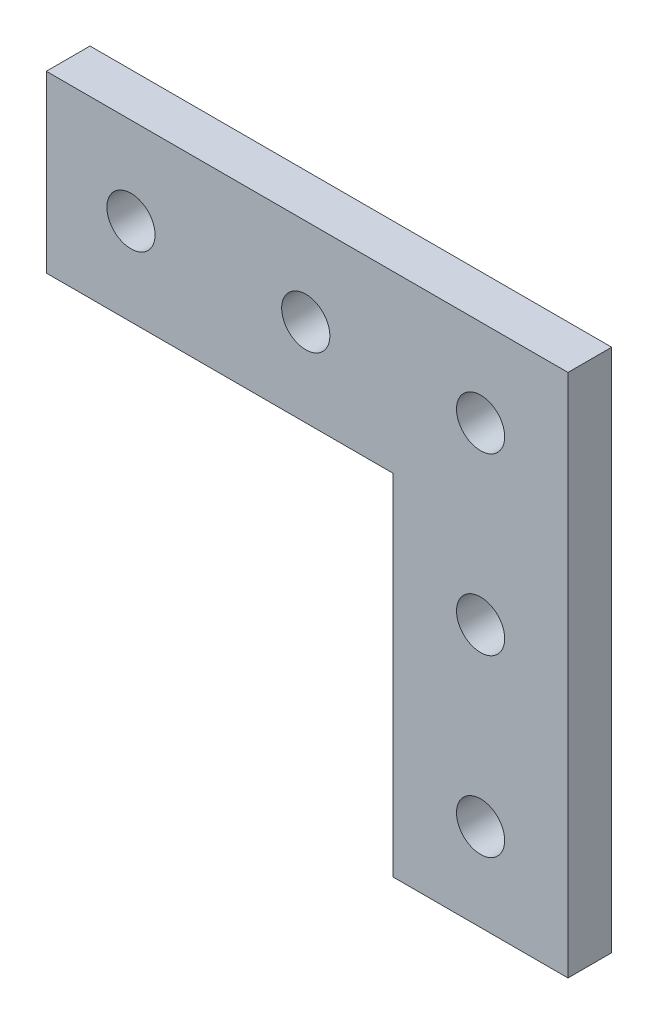
ISO-10303-21;
HEADER;
FILE_DESCRIPTION(('STEP AP214'),'2;1');
FILE_NAME('part.step','',(''),(''),'','','');
FILE_SCHEMA(('AUTOMOTIVE_DESIGN { 1 0 10303 214 1 1 1 1 }'));
ENDSEC;
DATA;
#1=APPLICATION_CONTEXT('core data for automotive mechanical design processes');
#2=APPLICATION_PROTOCOL_DEFINITION('international standard','automotive_design',2000,#1);
#3=PRODUCT_CONTEXT('',#1,'mechanical');
#4=PRODUCT('Part','Part','',(#3));
#5=PRODUCT_RELATED_PRODUCT_CATEGORY('part','',(#4));
#6=PRODUCT_DEFINITION_FORMATION('','',#4);
#7=PRODUCT_DEFINITION_CONTEXT('part definition',#1,'design');
#8=PRODUCT_DEFINITION('design','',#6,#7);
#9=PRODUCT_DEFINITION_SHAPE('','',#8);
#10=(LENGTH_UNIT() NAMED_UNIT(*) SI_UNIT(.MILLI.,.METRE.));
#11=(NAMED_UNIT(*) PLANE_ANGLE_UNIT() SI_UNIT($,.RADIAN.));
#12=(NAMED_UNIT(*) SI_UNIT($,.STERADIAN.) SOLID_ANGLE_UNIT());
#13=UNCERTAINTY_MEASURE_WITH_UNIT(LENGTH_MEASURE(1.E-05),#10,'distance_accuracy_value','');
#14=(GEOMETRIC_REPRESENTATION_CONTEXT(3) GLOBAL_UNCERTAINTY_ASSIGNED_CONTEXT((#13)) GLOBAL_UNIT_ASSIGNED_CONTEXT((#10,
#11,#12)) REPRESENTATION_CONTEXT('',''));
#15=CARTESIAN_POINT('',(0.,0.,0.));
#16=DIRECTION('',(0.,0.,1.));
#17=DIRECTION('',(1.,0.,0.));
#18=AXIS2_PLACEMENT_3D('',#15,#16,#17);
#19=CARTESIAN_POINT('',(12.7,50.8,6.35));
#20=DIRECTION('',(-1.,0.,0.));
#21=DIRECTION('',(0.,0.,1.));
#22=AXIS2_PLACEMENT_3D('',#19,#20,#21);
#23=PLANE('',#22);
#24=DIRECTION('',(0.,1.,0.));
#25=VECTOR('',#24,1.);
#26=CARTESIAN_POINT('',(12.7,50.8,0.));
#27=LINE('',#26,#25);
#28=CARTESIAN_POINT('',(12.7,0.,0.));
#29=VERTEX_POINT('',#28);
#30=CARTESIAN_POINT('',(12.7,76.2,0.));
#31=VERTEX_POINT('',#30);
#32=EDGE_CURVE('E83',#29,#31,#27,.T.);
#33=ORIENTED_EDGE('',*,*,#32,.T.);
#34=DIRECTION('',(0.,0.,-1.));
#35=VECTOR('',#34,1.);
#36=CARTESIAN_POINT('',(12.7,76.2,6.35));
#37=LINE('',#36,#35);
#38=CARTESIAN_POINT('',(12.7,76.2,6.35));
#39=VERTEX_POINT('',#38);
#40=EDGE_CURVE('E11',#39,#31,#37,.T.);
#41=ORIENTED_EDGE('',*,*,#40,.F.);
#42=DIRECTION('',(0.,1.,0.));
#43=VECTOR('',#42,1.);
#44=CARTESIAN_POINT('',(12.7,50.8,6.35));
#45=LINE('',#44,#43);
#46=CARTESIAN_POINT('',(12.7,0.,6.35));
#47=VERTEX_POINT('',#46);
#48=EDGE_CURVE('E89',#47,#39,#45,.T.);
#49=ORIENTED_EDGE('',*,*,#48,.F.);
#50=DIRECTION('',(0.,0.,-1.));
#51=VECTOR('',#50,1.);
#52=CARTESIAN_POINT('',(12.7,0.,6.35));
#53=LINE('',#52,#51);
#54=EDGE_CURVE('E117',#47,#29,#53,.T.);
#55=ORIENTED_EDGE('',*,*,#54,.T.);
#56=EDGE_LOOP('',(#33,#41,#49,#55));
#57=FACE_BOUND('',#56,.T.);
#58=ADVANCED_FACE('F37',(#57),#23,.F.);
#59=CARTESIAN_POINT('',(12.7,76.2,6.35));
#60=DIRECTION('',(0.,-1.,0.));
#61=DIRECTION('',(0.,0.,-1.));
#62=AXIS2_PLACEMENT_3D('',#59,#60,#61);
#63=PLANE('',#62);
#64=DIRECTION('',(-1.,0.,0.));
#65=VECTOR('',#64,1.);
#66=CARTESIAN_POINT('',(12.7,76.2,0.));
#67=LINE('',#66,#65);
#68=CARTESIAN_POINT('',(-63.1,76.2,0.));
#69=VERTEX_POINT('',#68);
#70=EDGE_CURVE('E122',#31,#69,#67,.T.);
#71=ORIENTED_EDGE('',*,*,#70,.T.);
#72=DIRECTION('',(0.,0.,-1.));
#73=VECTOR('',#72,1.);
#74=CARTESIAN_POINT('',(-63.1,76.2,6.35));
#75=LINE('',#74,#73);
#76=CARTESIAN_POINT('',(-63.1,76.2,6.35));
#77=VERTEX_POINT('',#76);
#78=EDGE_CURVE('E45',#77,#69,#75,.T.);
#79=ORIENTED_EDGE('',*,*,#78,.F.);
#80=DIRECTION('',(-1.,0.,0.));
#81=VECTOR('',#80,1.);
#82=CARTESIAN_POINT('',(12.7,76.2,6.35));
#83=LINE('',#82,#81);
#84=EDGE_CURVE('E145',#39,#77,#83,.T.);
#85=ORIENTED_EDGE('',*,*,#84,.F.);
#86=ORIENTED_EDGE('',*,*,#40,.T.);
#87=EDGE_LOOP('',(#71,#79,#85,#86));
#88=FACE_BOUND('',#87,.T.);
#89=ADVANCED_FACE('F214',(#88),#63,.F.);
#90=CARTESIAN_POINT('',(-63.1,76.2,6.35));
#91=DIRECTION('',(1.,0.,0.));
#92=DIRECTION('',(0.,0.,-1.));
#93=AXIS2_PLACEMENT_3D('',#90,#91,#92);
#94=PLANE('',#93);
#95=DIRECTION('',(0.,-1.,0.));
#96=VECTOR('',#95,1.);
#97=CARTESIAN_POINT('',(-63.1,76.2,0.));
#98=LINE('',#97,#96);
#99=CARTESIAN_POINT('',(-63.1,50.8,0.));
#100=VERTEX_POINT('',#99);
#101=EDGE_CURVE('E125',#69,#100,#98,.T.);
#102=ORIENTED_EDGE('',*,*,#101,.T.);
#103=DIRECTION('',(0.,0.,-1.));
#104=VECTOR('',#103,1.);
#105=CARTESIAN_POINT('',(-63.1,50.8,6.35));
#106=LINE('',#105,#104);
#107=CARTESIAN_POINT('',(-63.1,50.8,6.35));
#108=VERTEX_POINT('',#107);
#109=EDGE_CURVE('E112',#108,#100,#106,.T.);
#110=ORIENTED_EDGE('',*,*,#109,.F.);
#111=DIRECTION('',(0.,-1.,0.));
#112=VECTOR('',#111,1.);
#113=CARTESIAN_POINT('',(-63.1,76.2,6.35));
#114=LINE('',#113,#112);
#115=EDGE_CURVE('E103',#77,#108,#114,.T.);
#116=ORIENTED_EDGE('',*,*,#115,.F.);
#117=ORIENTED_EDGE('',*,*,#78,.T.);
#118=EDGE_LOOP('',(#102,#110,#116,#117));
#119=FACE_BOUND('',#118,.T.);
#120=ADVANCED_FACE('F138',(#119),#94,.F.);
#121=CARTESIAN_POINT('',(-63.1,50.8,6.35));
#122=DIRECTION('',(0.,1.,0.));
#123=DIRECTION('',(0.,0.,1.));
#124=AXIS2_PLACEMENT_3D('',#121,#122,#123);
#125=PLANE('',#124);
#126=DIRECTION('',(1.,0.,0.));
#127=VECTOR('',#126,1.);
#128=CARTESIAN_POINT('',(-63.1,50.8,0.));
#129=LINE('',#128,#127);
#130=CARTESIAN_POINT('',(-12.7,50.8,0.));
#131=VERTEX_POINT('',#130);
#132=EDGE_CURVE('E111',#100,#131,#129,.T.);
#133=ORIENTED_EDGE('',*,*,#132,.T.);
#134=DIRECTION('',(0.,0.,-1.));
#135=VECTOR('',#134,1.);
#136=CARTESIAN_POINT('',(-12.7,50.8,6.35));
#137=LINE('',#136,#135);
#138=CARTESIAN_POINT('',(-12.7,50.8,6.35));
#139=VERTEX_POINT('',#138);
#140=EDGE_CURVE('E108',#139,#131,#137,.T.);
#141=ORIENTED_EDGE('',*,*,#140,.F.);
#142=DIRECTION('',(1.,0.,0.));
#143=VECTOR('',#142,1.);
#144=CARTESIAN_POINT('',(-63.1,50.8,6.35));
#145=LINE('',#144,#143);
#146=EDGE_CURVE('E97',#108,#139,#145,.T.);
#147=ORIENTED_EDGE('',*,*,#146,.F.);
#148=ORIENTED_EDGE('',*,*,#109,.T.);
#149=EDGE_LOOP('',(#133,#141,#147,#148));
#150=FACE_BOUND('',#149,.T.);
#151=ADVANCED_FACE('F109',(#150),#125,.F.);
#152=CARTESIAN_POINT('',(-12.7,0.,6.35));
#153=DIRECTION('',(1.,0.,0.));
#154=DIRECTION('',(0.,0.,-1.));
#155=AXIS2_PLACEMENT_3D('',#152,#153,#154);
#156=PLANE('',#155);
#157=DIRECTION('',(0.,-1.,0.));
#158=VECTOR('',#157,1.);
#159=CARTESIAN_POINT('',(-12.7,0.,0.));
#160=LINE('',#159,#158);
#161=CARTESIAN_POINT('',(-12.7,0.,0.));
#162=VERTEX_POINT('',#161);
#163=EDGE_CURVE('E76',#131,#162,#160,.T.);
#164=ORIENTED_EDGE('',*,*,#163,.T.);
#165=DIRECTION('',(0.,0.,-1.));
#166=VECTOR('',#165,1.);
#167=CARTESIAN_POINT('',(-12.7,0.,6.35));
#168=LINE('',#167,#166);
#169=CARTESIAN_POINT('',(-12.7,0.,6.35));
#170=VERTEX_POINT('',#169);
#171=EDGE_CURVE('E113',#170,#162,#168,.T.);
#172=ORIENTED_EDGE('',*,*,#171,.F.);
#173=DIRECTION('',(0.,-1.,0.));
#174=VECTOR('',#173,1.);
#175=CARTESIAN_POINT('',(-12.7,0.,6.35));
#176=LINE('',#175,#174);
#177=EDGE_CURVE('E101',#139,#170,#176,.T.);
#178=ORIENTED_EDGE('',*,*,#177,.F.);
#179=ORIENTED_EDGE('',*,*,#140,.T.);
#180=EDGE_LOOP('',(#164,#172,#178,#179));
#181=FACE_BOUND('',#180,.T.);
#182=ADVANCED_FACE('F115',(#181),#156,.F.);
#183=CARTESIAN_POINT('',(12.7,0.,6.35));
#184=DIRECTION('',(0.,1.,0.));
#185=DIRECTION('',(-1.,0.,0.));
#186=AXIS2_PLACEMENT_3D('',#183,#184,#185);
#187=PLANE('',#186);
#188=DIRECTION('',(1.,0.,0.));
#189=VECTOR('',#188,1.);
#190=CARTESIAN_POINT('',(12.7,0.,0.));
#191=LINE('',#190,#189);
#192=EDGE_CURVE('E129',#162,#29,#191,.T.);
#193=ORIENTED_EDGE('',*,*,#192,.T.);
#194=ORIENTED_EDGE('',*,*,#54,.F.);
#195=DIRECTION('',(1.,0.,0.));
#196=VECTOR('',#195,1.);
#197=CARTESIAN_POINT('',(12.7,0.,6.35));
#198=LINE('',#197,#196);
#199=EDGE_CURVE('E53',#170,#47,#198,.T.);
#200=ORIENTED_EDGE('',*,*,#199,.F.);
#201=ORIENTED_EDGE('',*,*,#171,.T.);
#202=EDGE_LOOP('',(#193,#194,#200,#201));
#203=FACE_BOUND('',#202,.T.);
#204=ADVANCED_FACE('F143',(#203),#187,.F.);
#205=CARTESIAN_POINT('',(0.,0.,6.35));
#206=DIRECTION('',(0.,0.,-1.));
#207=DIRECTION('',(-1.,0.,0.));
#208=AXIS2_PLACEMENT_3D('',#205,#206,#207);
#209=PLANE('',#208);
#210=CARTESIAN_POINT('',(-50.8,63.5,6.35));
#211=DIRECTION('',(0.,0.,1.));
#212=DIRECTION('',(1.,0.,0.));
#213=AXIS2_PLACEMENT_3D('',#210,#211,#212);
#214=CIRCLE('',#213,3.5);
#215=CARTESIAN_POINT('',(-47.3,63.5,6.35));
#216=VERTEX_POINT('',#215);
#217=EDGE_CURVE('E173',#216,#216,#214,.T.);
#218=ORIENTED_EDGE('',*,*,#217,.F.);
#219=EDGE_LOOP('',(#218));
#220=FACE_BOUND('',#219,.T.);
#221=CARTESIAN_POINT('',(0.,63.5,6.35));
#222=DIRECTION('',(0.,0.,1.));
#223=DIRECTION('',(1.,0.,0.));
#224=AXIS2_PLACEMENT_3D('',#221,#222,#223);
#225=CIRCLE('',#224,3.5);
#226=CARTESIAN_POINT('',(3.5,63.5,6.35));
#227=VERTEX_POINT('',#226);
#228=EDGE_CURVE('E167',#227,#227,#225,.T.);
#229=ORIENTED_EDGE('',*,*,#228,.F.);
#230=EDGE_LOOP('',(#229));
#231=FACE_BOUND('',#230,.T.);
#232=CARTESIAN_POINT('',(-25.4,63.5,6.35));
#233=DIRECTION('',(0.,0.,1.));
#234=DIRECTION('',(1.,0.,0.));
#235=AXIS2_PLACEMENT_3D('',#232,#233,#234);
#236=CIRCLE('',#235,3.5);
#237=CARTESIAN_POINT('',(-21.9,63.5,6.35));
#238=VERTEX_POINT('',#237);
#239=EDGE_CURVE('E161',#238,#238,#236,.T.);
#240=ORIENTED_EDGE('',*,*,#239,.F.);
#241=EDGE_LOOP('',(#240));
#242=FACE_BOUND('',#241,.T.);
#243=CARTESIAN_POINT('',(0.,38.1,6.35));
#244=DIRECTION('',(0.,0.,1.));
#245=DIRECTION('',(1.,0.,0.));
#246=AXIS2_PLACEMENT_3D('',#243,#244,#245);
#247=CIRCLE('',#246,3.5);
#248=CARTESIAN_POINT('',(3.5,38.1,6.35));
#249=VERTEX_POINT('',#248);
#250=EDGE_CURVE('E155',#249,#249,#247,.T.);
#251=ORIENTED_EDGE('',*,*,#250,.F.);
#252=EDGE_LOOP('',(#251));
#253=FACE_BOUND('',#252,.T.);
#254=CARTESIAN_POINT('',(0.,12.7,6.35));
#255=DIRECTION('',(0.,0.,1.));
#256=DIRECTION('',(1.,0.,0.));
#257=AXIS2_PLACEMENT_3D('',#254,#255,#256);
#258=CIRCLE('',#257,3.5);
#259=CARTESIAN_POINT('',(3.5,12.7,6.35));
#260=VERTEX_POINT('',#259);
#261=EDGE_CURVE('E149',#260,#260,#258,.T.);
#262=ORIENTED_EDGE('',*,*,#261,.F.);
#263=EDGE_LOOP('',(#262));
#264=FACE_BOUND('',#263,.T.);
#265=ORIENTED_EDGE('',*,*,#48,.T.);
#266=ORIENTED_EDGE('',*,*,#84,.T.);
#267=ORIENTED_EDGE('',*,*,#115,.T.);
#268=ORIENTED_EDGE('',*,*,#146,.T.);
#269=ORIENTED_EDGE('',*,*,#177,.T.);
#270=ORIENTED_EDGE('',*,*,#199,.T.);
#271=EDGE_LOOP('',(#265,#266,#267,#268,#269,#270));
#272=FACE_BOUND('',#271,.T.);
#273=ADVANCED_FACE('F99',(#220,#231,#242,#253,#264,#272),#209,.F.);
#274=CARTESIAN_POINT('',(0.,0.,0.));
#275=DIRECTION('',(0.,0.,-1.));
#276=DIRECTION('',(-1.,0.,0.));
#277=AXIS2_PLACEMENT_3D('',#274,#275,#276);
#278=PLANE('',#277);
#279=CARTESIAN_POINT('',(-50.8,63.5,0.));
#280=DIRECTION('',(0.,0.,1.));
#281=DIRECTION('',(1.,0.,0.));
#282=AXIS2_PLACEMENT_3D('',#279,#280,#281);
#283=CIRCLE('',#282,3.5);
#284=CARTESIAN_POINT('',(-47.3,63.5,0.));
#285=VERTEX_POINT('',#284);
#286=EDGE_CURVE('E123',#285,#285,#283,.T.);
#287=ORIENTED_EDGE('',*,*,#286,.T.);
#288=EDGE_LOOP('',(#287));
#289=FACE_BOUND('',#288,.T.);
#290=CARTESIAN_POINT('',(0.,63.5,0.));
#291=DIRECTION('',(0.,0.,1.));
#292=DIRECTION('',(1.,0.,0.));
#293=AXIS2_PLACEMENT_3D('',#290,#291,#292);
#294=CIRCLE('',#293,3.5);
#295=CARTESIAN_POINT('',(3.5,63.5,0.));
#296=VERTEX_POINT('',#295);
#297=EDGE_CURVE('E170',#296,#296,#294,.T.);
#298=ORIENTED_EDGE('',*,*,#297,.T.);
#299=EDGE_LOOP('',(#298));
#300=FACE_BOUND('',#299,.T.);
#301=CARTESIAN_POINT('',(-25.4,63.5,0.));
#302=DIRECTION('',(0.,0.,1.));
#303=DIRECTION('',(1.,0.,0.));
#304=AXIS2_PLACEMENT_3D('',#301,#302,#303);
#305=CIRCLE('',#304,3.5);
#306=CARTESIAN_POINT('',(-21.9,63.5,0.));
#307=VERTEX_POINT('',#306);
#308=EDGE_CURVE('E164',#307,#307,#305,.T.);
#309=ORIENTED_EDGE('',*,*,#308,.T.);
#310=EDGE_LOOP('',(#309));
#311=FACE_BOUND('',#310,.T.);
#312=CARTESIAN_POINT('',(0.,38.1,0.));
#313=DIRECTION('',(0.,0.,1.));
#314=DIRECTION('',(1.,0.,0.));
#315=AXIS2_PLACEMENT_3D('',#312,#313,#314);
#316=CIRCLE('',#315,3.5);
#317=CARTESIAN_POINT('',(3.5,38.1,0.));
#318=VERTEX_POINT('',#317);
#319=EDGE_CURVE('E158',#318,#318,#316,.T.);
#320=ORIENTED_EDGE('',*,*,#319,.T.);
#321=EDGE_LOOP('',(#320));
#322=FACE_BOUND('',#321,.T.);
#323=CARTESIAN_POINT('',(0.,12.7,0.));
#324=DIRECTION('',(0.,0.,1.));
#325=DIRECTION('',(1.,0.,0.));
#326=AXIS2_PLACEMENT_3D('',#323,#324,#325);
#327=CIRCLE('',#326,3.5);
#328=CARTESIAN_POINT('',(3.5,12.7,0.));
#329=VERTEX_POINT('',#328);
#330=EDGE_CURVE('E152',#329,#329,#327,.T.);
#331=ORIENTED_EDGE('',*,*,#330,.T.);
#332=EDGE_LOOP('',(#331));
#333=FACE_BOUND('',#332,.T.);
#334=ORIENTED_EDGE('',*,*,#32,.F.);
#335=ORIENTED_EDGE('',*,*,#192,.F.);
#336=ORIENTED_EDGE('',*,*,#163,.F.);
#337=ORIENTED_EDGE('',*,*,#132,.F.);
#338=ORIENTED_EDGE('',*,*,#101,.F.);
#339=ORIENTED_EDGE('',*,*,#70,.F.);
#340=EDGE_LOOP('',(#334,#335,#336,#337,#338,#339));
#341=FACE_BOUND('',#340,.T.);
#342=ADVANCED_FACE('F141',(#289,#300,#311,#322,#333,#341),#278,.T.);
#343=CARTESIAN_POINT('',(0.,12.7,0.));
#344=DIRECTION('',(0.,0.,1.));
#345=DIRECTION('',(1.,0.,0.));
#346=AXIS2_PLACEMENT_3D('',#343,#344,#345);
#347=CYLINDRICAL_SURFACE('',#346,3.5);
#348=ORIENTED_EDGE('',*,*,#330,.F.);
#349=EDGE_LOOP('',(#348));
#350=FACE_BOUND('',#349,.T.);
#351=ORIENTED_EDGE('',*,*,#261,.T.);
#352=EDGE_LOOP('',(#351));
#353=FACE_BOUND('',#352,.T.);
#354=ADVANCED_FACE('F199',(#350,#353),#347,.F.);
#355=CARTESIAN_POINT('',(0.,38.1,0.));
#356=DIRECTION('',(0.,0.,1.));
#357=DIRECTION('',(1.,0.,0.));
#358=AXIS2_PLACEMENT_3D('',#355,#356,#357);
#359=CYLINDRICAL_SURFACE('',#358,3.5);
#360=ORIENTED_EDGE('',*,*,#319,.F.);
#361=EDGE_LOOP('',(#360));
#362=FACE_BOUND('',#361,.T.);
#363=ORIENTED_EDGE('',*,*,#250,.T.);
#364=EDGE_LOOP('',(#363));
#365=FACE_BOUND('',#364,.T.);
#366=ADVANCED_FACE('F201',(#362,#365),#359,.F.);
#367=CARTESIAN_POINT('',(-25.4,63.5,0.));
#368=DIRECTION('',(0.,0.,1.));
#369=DIRECTION('',(1.,0.,0.));
#370=AXIS2_PLACEMENT_3D('',#367,#368,#369);
#371=CYLINDRICAL_SURFACE('',#370,3.5);
#372=ORIENTED_EDGE('',*,*,#308,.F.);
#373=EDGE_LOOP('',(#372));
#374=FACE_BOUND('',#373,.T.);
#375=ORIENTED_EDGE('',*,*,#239,.T.);
#376=EDGE_LOOP('',(#375));
#377=FACE_BOUND('',#376,.T.);
#378=ADVANCED_FACE('F208',(#374,#377),#371,.F.);
#379=CARTESIAN_POINT('',(0.,63.5,0.));
#380=DIRECTION('',(0.,0.,1.));
#381=DIRECTION('',(1.,0.,0.));
#382=AXIS2_PLACEMENT_3D('',#379,#380,#381);
#383=CYLINDRICAL_SURFACE('',#382,3.5);
#384=ORIENTED_EDGE('',*,*,#297,.F.);
#385=EDGE_LOOP('',(#384));
#386=FACE_BOUND('',#385,.T.);
#387=ORIENTED_EDGE('',*,*,#228,.T.);
#388=EDGE_LOOP('',(#387));
#389=FACE_BOUND('',#388,.T.);
#390=ADVANCED_FACE('F184',(#386,#389),#383,.F.);
#391=CARTESIAN_POINT('',(-50.8,63.5,0.));
#392=DIRECTION('',(0.,0.,1.));
#393=DIRECTION('',(1.,0.,0.));
#394=AXIS2_PLACEMENT_3D('',#391,#392,#393);
#395=CYLINDRICAL_SURFACE('',#394,3.5);
#396=ORIENTED_EDGE('',*,*,#286,.F.);
#397=EDGE_LOOP('',(#396));
#398=FACE_BOUND('',#397,.T.);
#399=ORIENTED_EDGE('',*,*,#217,.T.);
#400=EDGE_LOOP('',(#399));
#401=FACE_BOUND('',#400,.T.);
#402=ADVANCED_FACE('F181',(#398,#401),#395,.F.);
#403=CLOSED_SHELL('',(#58,#89,#120,#151,#182,#204,#273,#342,#354,#366,#378,#390,#402));
#404=MANIFOLD_SOLID_BREP('B2',#403);
#405=ADVANCED_BREP_SHAPE_REPRESENTATION('',(#18,#404),#14);
#406=SHAPE_DEFINITION_REPRESENTATION(#9,#405);
ENDSEC;
END-ISO-10303-21;
